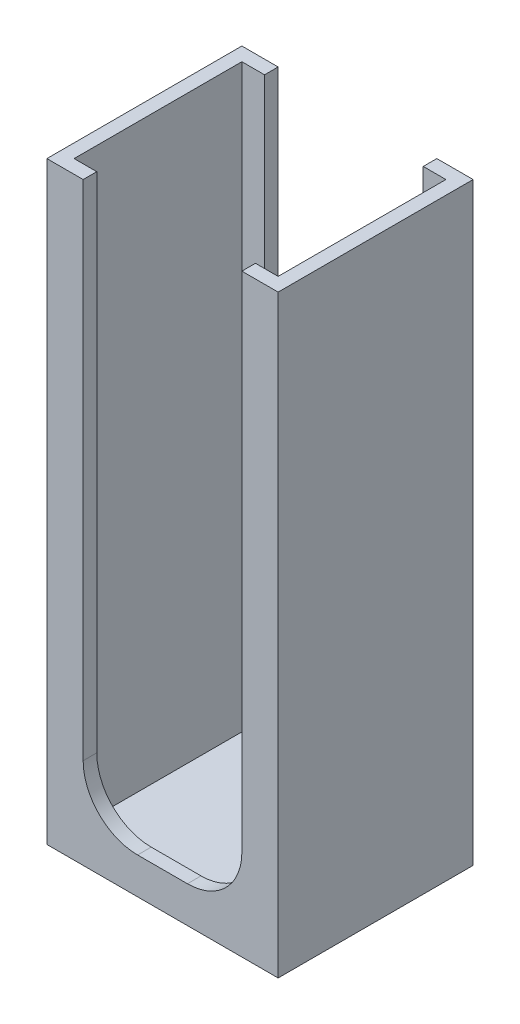
ISO-10303-21;
HEADER;
FILE_DESCRIPTION(('STEP AP214'),'2;1');
FILE_NAME('part.step','',(''),(''),'','','');
FILE_SCHEMA(('AUTOMOTIVE_DESIGN { 1 0 10303 214 1 1 1 1 }'));
ENDSEC;
DATA;
#1=APPLICATION_CONTEXT('core data for automotive mechanical design processes');
#2=APPLICATION_PROTOCOL_DEFINITION('international standard','automotive_design',2000,#1);
#3=PRODUCT_CONTEXT('',#1,'mechanical');
#4=PRODUCT('Part','Part','',(#3));
#5=PRODUCT_RELATED_PRODUCT_CATEGORY('part','',(#4));
#6=PRODUCT_DEFINITION_FORMATION('','',#4);
#7=PRODUCT_DEFINITION_CONTEXT('part definition',#1,'design');
#8=PRODUCT_DEFINITION('design','',#6,#7);
#9=PRODUCT_DEFINITION_SHAPE('','',#8);
#10=(LENGTH_UNIT() NAMED_UNIT(*) SI_UNIT(.MILLI.,.METRE.));
#11=(NAMED_UNIT(*) PLANE_ANGLE_UNIT() SI_UNIT($,.RADIAN.));
#12=(NAMED_UNIT(*) SI_UNIT($,.STERADIAN.) SOLID_ANGLE_UNIT());
#13=UNCERTAINTY_MEASURE_WITH_UNIT(LENGTH_MEASURE(1.E-05),#10,'distance_accuracy_value','');
#14=(GEOMETRIC_REPRESENTATION_CONTEXT(3) GLOBAL_UNCERTAINTY_ASSIGNED_CONTEXT((#13)) GLOBAL_UNIT_ASSIGNED_CONTEXT((#10,
#11,#12)) REPRESENTATION_CONTEXT('',''));
#15=CARTESIAN_POINT('',(0.,0.,0.));
#16=DIRECTION('',(0.,0.,1.));
#17=DIRECTION('',(1.,0.,0.));
#18=AXIS2_PLACEMENT_3D('',#15,#16,#17);
#19=CARTESIAN_POINT('',(0.,65.5,0.));
#20=DIRECTION('',(0.,-1.,0.));
#21=DIRECTION('',(0.,0.,-1.));
#22=AXIS2_PLACEMENT_3D('',#19,#20,#21);
#23=PLANE('',#22);
#24=DIRECTION('',(-1.,0.,0.));
#25=VECTOR('',#24,1.);
#26=CARTESIAN_POINT('',(-66.5960795488793,65.5,14.2931687371756));
#27=LINE('',#26,#25);
#28=CARTESIAN_POINT('',(-41.0960795488793,65.5,14.2931687371756));
#29=VERTEX_POINT('',#28);
#30=CARTESIAN_POINT('',(-45.0960795488793,65.5,14.2931687371756));
#31=VERTEX_POINT('',#30);
#32=EDGE_CURVE('E189',#29,#31,#27,.T.);
#33=ORIENTED_EDGE('',*,*,#32,.T.);
#34=DIRECTION('',(0.,0.,1.));
#35=VECTOR('',#34,1.);
#36=CARTESIAN_POINT('',(-45.0960795488793,65.5,14.2931687371756));
#37=LINE('',#36,#35);
#38=CARTESIAN_POINT('',(-45.0960795488793,65.5,15.7931687371756));
#39=VERTEX_POINT('',#38);
#40=EDGE_CURVE('E170',#31,#39,#37,.T.);
#41=ORIENTED_EDGE('',*,*,#40,.T.);
#42=DIRECTION('',(-1.,0.,0.));
#43=VECTOR('',#42,1.);
#44=CARTESIAN_POINT('',(-65.0960795488793,65.5,15.7931687371756));
#45=LINE('',#44,#43);
#46=CARTESIAN_POINT('',(-42.5960795488793,65.5,15.7931687371756));
#47=VERTEX_POINT('',#46);
#48=EDGE_CURVE('E284',#47,#39,#45,.T.);
#49=ORIENTED_EDGE('',*,*,#48,.F.);
#50=DIRECTION('',(0.,0.,-1.));
#51=VECTOR('',#50,1.);
#52=CARTESIAN_POINT('',(-42.5960795488793,65.5,15.7931687371756));
#53=LINE('',#52,#51);
#54=CARTESIAN_POINT('',(-42.5960795488793,65.5,34.2931687371756));
#55=VERTEX_POINT('',#54);
#56=EDGE_CURVE('E299',#55,#47,#53,.T.);
#57=ORIENTED_EDGE('',*,*,#56,.F.);
#58=DIRECTION('',(1.,0.,0.));
#59=VECTOR('',#58,1.);
#60=CARTESIAN_POINT('',(-65.0960795488793,65.5,34.2931687371756));
#61=LINE('',#60,#59);
#62=CARTESIAN_POINT('',(-45.0960795488793,65.5,34.2931687371756));
#63=VERTEX_POINT('',#62);
#64=EDGE_CURVE('E295',#63,#55,#61,.T.);
#65=ORIENTED_EDGE('',*,*,#64,.F.);
#66=CARTESIAN_POINT('',(-45.0960795488793,65.5,35.7931687371756));
#67=VERTEX_POINT('',#66);
#68=EDGE_CURVE('E183',#63,#67,#37,.T.);
#69=ORIENTED_EDGE('',*,*,#68,.T.);
#70=DIRECTION('',(1.,0.,0.));
#71=VECTOR('',#70,1.);
#72=CARTESIAN_POINT('',(-66.5960795488793,65.5,35.7931687371756));
#73=LINE('',#72,#71);
#74=CARTESIAN_POINT('',(-41.0960795488793,65.5,35.7931687371756));
#75=VERTEX_POINT('',#74);
#76=EDGE_CURVE('E314',#67,#75,#73,.T.);
#77=ORIENTED_EDGE('',*,*,#76,.T.);
#78=DIRECTION('',(0.,0.,-1.));
#79=VECTOR('',#78,1.);
#80=CARTESIAN_POINT('',(-41.0960795488793,65.5,35.7931687371756));
#81=LINE('',#80,#79);
#82=EDGE_CURVE('E197',#75,#29,#81,.T.);
#83=ORIENTED_EDGE('',*,*,#82,.T.);
#84=EDGE_LOOP('',(#33,#41,#49,#57,#65,#69,#77,#83));
#85=FACE_BOUND('',#84,.T.);
#86=ADVANCED_FACE('F33',(#85),#23,.F.);
#87=CARTESIAN_POINT('',(-66.5960795488793,65.5,35.7931687371756));
#88=DIRECTION('',(1.,0.,0.));
#89=DIRECTION('',(0.,0.,-1.));
#90=AXIS2_PLACEMENT_3D('',#87,#88,#89);
#91=PLANE('',#90);
#92=DIRECTION('',(0.,0.,1.));
#93=VECTOR('',#92,1.);
#94=CARTESIAN_POINT('',(-66.5960795488793,0.,35.7931687371756));
#95=LINE('',#94,#93);
#96=CARTESIAN_POINT('',(-66.5960795488793,0.,14.2931687371756));
#97=VERTEX_POINT('',#96);
#98=CARTESIAN_POINT('',(-66.5960795488793,0.,35.7931687371756));
#99=VERTEX_POINT('',#98);
#100=EDGE_CURVE('E208',#97,#99,#95,.T.);
#101=ORIENTED_EDGE('',*,*,#100,.T.);
#102=DIRECTION('',(0.,-1.,0.));
#103=VECTOR('',#102,1.);
#104=CARTESIAN_POINT('',(-66.5960795488793,65.5,35.7931687371756));
#105=LINE('',#104,#103);
#106=CARTESIAN_POINT('',(-66.5960795488793,65.5,35.7931687371756));
#107=VERTEX_POINT('',#106);
#108=EDGE_CURVE('E223',#107,#99,#105,.T.);
#109=ORIENTED_EDGE('',*,*,#108,.F.);
#110=DIRECTION('',(0.,0.,1.));
#111=VECTOR('',#110,1.);
#112=CARTESIAN_POINT('',(-66.5960795488793,65.5,35.7931687371756));
#113=LINE('',#112,#111);
#114=CARTESIAN_POINT('',(-66.5960795488793,65.5,14.2931687371756));
#115=VERTEX_POINT('',#114);
#116=EDGE_CURVE('E217',#115,#107,#113,.T.);
#117=ORIENTED_EDGE('',*,*,#116,.F.);
#118=DIRECTION('',(0.,-1.,0.));
#119=VECTOR('',#118,1.);
#120=CARTESIAN_POINT('',(-66.5960795488793,65.5,14.2931687371756));
#121=LINE('',#120,#119);
#122=EDGE_CURVE('E199',#115,#97,#121,.T.);
#123=ORIENTED_EDGE('',*,*,#122,.T.);
#124=EDGE_LOOP('',(#101,#109,#117,#123));
#125=FACE_BOUND('',#124,.T.);
#126=ADVANCED_FACE('F35',(#125),#91,.F.);
#127=CARTESIAN_POINT('',(-66.5960795488793,65.5,35.7931687371756));
#128=DIRECTION('',(0.,0.,-1.));
#129=DIRECTION('',(-1.,0.,0.));
#130=AXIS2_PLACEMENT_3D('',#127,#128,#129);
#131=PLANE('',#130);
#132=ORIENTED_EDGE('',*,*,#76,.F.);
#133=DIRECTION('',(0.,1.,0.));
#134=VECTOR('',#133,1.);
#135=CARTESIAN_POINT('',(-45.0960795488793,65.5,35.7931687371756));
#136=LINE('',#135,#134);
#137=CARTESIAN_POINT('',(-45.0960795488793,10.,35.7931687371756));
#138=VERTEX_POINT('',#137);
#139=EDGE_CURVE('E362',#138,#67,#136,.T.);
#140=ORIENTED_EDGE('',*,*,#139,.F.);
#141=CARTESIAN_POINT('',(-51.0960795488793,10.,35.7931687371756));
#142=DIRECTION('',(0.,0.,1.));
#143=DIRECTION('',(-1.,0.,0.));
#144=AXIS2_PLACEMENT_3D('',#141,#142,#143);
#145=CIRCLE('',#144,6.);
#146=CARTESIAN_POINT('',(-51.0960795488794,4.,35.7931687371756));
#147=VERTEX_POINT('',#146);
#148=EDGE_CURVE('E194',#147,#138,#145,.T.);
#149=ORIENTED_EDGE('',*,*,#148,.F.);
#150=DIRECTION('',(1.,0.,0.));
#151=VECTOR('',#150,1.);
#152=CARTESIAN_POINT('',(-51.0960795488794,4.,35.7931687371756));
#153=LINE('',#152,#151);
#154=CARTESIAN_POINT('',(-56.5960795488793,4.,35.7931687371756));
#155=VERTEX_POINT('',#154);
#156=EDGE_CURVE('E250',#155,#147,#153,.T.);
#157=ORIENTED_EDGE('',*,*,#156,.F.);
#158=CARTESIAN_POINT('',(-56.5960795488793,10.,35.7931687371756));
#159=DIRECTION('',(0.,0.,1.));
#160=DIRECTION('',(-1.,0.,0.));
#161=AXIS2_PLACEMENT_3D('',#158,#159,#160);
#162=CIRCLE('',#161,6.);
#163=CARTESIAN_POINT('',(-62.5960795488793,10.,35.7931687371756));
#164=VERTEX_POINT('',#163);
#165=EDGE_CURVE('E361',#164,#155,#162,.T.);
#166=ORIENTED_EDGE('',*,*,#165,.F.);
#167=DIRECTION('',(0.,-1.,0.));
#168=VECTOR('',#167,1.);
#169=CARTESIAN_POINT('',(-62.5960795488793,65.5,35.7931687371756));
#170=LINE('',#169,#168);
#171=CARTESIAN_POINT('',(-62.5960795488793,65.5,35.7931687371756));
#172=VERTEX_POINT('',#171);
#173=EDGE_CURVE('E358',#172,#164,#170,.T.);
#174=ORIENTED_EDGE('',*,*,#173,.F.);
#175=EDGE_CURVE('E315',#107,#172,#73,.T.);
#176=ORIENTED_EDGE('',*,*,#175,.F.);
#177=ORIENTED_EDGE('',*,*,#108,.T.);
#178=DIRECTION('',(1.,0.,0.));
#179=VECTOR('',#178,1.);
#180=CARTESIAN_POINT('',(-66.5960795488793,0.,35.7931687371756));
#181=LINE('',#180,#179);
#182=CARTESIAN_POINT('',(-41.0960795488793,0.,35.7931687371756));
#183=VERTEX_POINT('',#182);
#184=EDGE_CURVE('E211',#99,#183,#181,.T.);
#185=ORIENTED_EDGE('',*,*,#184,.T.);
#186=DIRECTION('',(0.,-1.,0.));
#187=VECTOR('',#186,1.);
#188=CARTESIAN_POINT('',(-41.0960795488793,65.5,35.7931687371756));
#189=LINE('',#188,#187);
#190=EDGE_CURVE('E220',#75,#183,#189,.T.);
#191=ORIENTED_EDGE('',*,*,#190,.F.);
#192=EDGE_LOOP('',(#132,#140,#149,#157,#166,#174,#176,#177,#185,#191));
#193=FACE_BOUND('',#192,.T.);
#194=ADVANCED_FACE('F324',(#193),#131,.F.);
#195=CARTESIAN_POINT('',(-41.0960795488793,65.5,35.7931687371756));
#196=DIRECTION('',(-1.,0.,0.));
#197=DIRECTION('',(0.,0.,1.));
#198=AXIS2_PLACEMENT_3D('',#195,#196,#197);
#199=PLANE('',#198);
#200=DIRECTION('',(0.,0.,-1.));
#201=VECTOR('',#200,1.);
#202=CARTESIAN_POINT('',(-41.0960795488793,0.,35.7931687371756));
#203=LINE('',#202,#201);
#204=CARTESIAN_POINT('',(-41.0960795488793,0.,14.2931687371756));
#205=VERTEX_POINT('',#204);
#206=EDGE_CURVE('E214',#183,#205,#203,.T.);
#207=ORIENTED_EDGE('',*,*,#206,.T.);
#208=DIRECTION('',(0.,-1.,0.));
#209=VECTOR('',#208,1.);
#210=CARTESIAN_POINT('',(-41.0960795488793,65.5,14.2931687371756));
#211=LINE('',#210,#209);
#212=EDGE_CURVE('E203',#29,#205,#211,.T.);
#213=ORIENTED_EDGE('',*,*,#212,.F.);
#214=ORIENTED_EDGE('',*,*,#82,.F.);
#215=ORIENTED_EDGE('',*,*,#190,.T.);
#216=EDGE_LOOP('',(#207,#213,#214,#215));
#217=FACE_BOUND('',#216,.T.);
#218=ADVANCED_FACE('F327',(#217),#199,.F.);
#219=CARTESIAN_POINT('',(-66.5960795488793,65.5,14.2931687371756));
#220=DIRECTION('',(0.,0.,1.));
#221=DIRECTION('',(1.,0.,0.));
#222=AXIS2_PLACEMENT_3D('',#219,#220,#221);
#223=PLANE('',#222);
#224=CARTESIAN_POINT('',(-51.0960795488793,10.,14.2931687371756));
#225=DIRECTION('',(0.,0.,1.));
#226=DIRECTION('',(-1.,0.,0.));
#227=AXIS2_PLACEMENT_3D('',#224,#225,#226);
#228=CIRCLE('',#227,6.);
#229=CARTESIAN_POINT('',(-51.0960795488794,4.,14.2931687371756));
#230=VERTEX_POINT('',#229);
#231=CARTESIAN_POINT('',(-45.0960795488793,10.,14.2931687371756));
#232=VERTEX_POINT('',#231);
#233=EDGE_CURVE('E192',#230,#232,#228,.T.);
#234=ORIENTED_EDGE('',*,*,#233,.T.);
#235=DIRECTION('',(0.,1.,0.));
#236=VECTOR('',#235,1.);
#237=CARTESIAN_POINT('',(-45.0960795488793,65.5,14.2931687371756));
#238=LINE('',#237,#236);
#239=EDGE_CURVE('E174',#232,#31,#238,.T.);
#240=ORIENTED_EDGE('',*,*,#239,.T.);
#241=ORIENTED_EDGE('',*,*,#32,.F.);
#242=ORIENTED_EDGE('',*,*,#212,.T.);
#243=DIRECTION('',(-1.,0.,0.));
#244=VECTOR('',#243,1.);
#245=CARTESIAN_POINT('',(-66.5960795488793,0.,14.2931687371756));
#246=LINE('',#245,#244);
#247=EDGE_CURVE('E216',#205,#97,#246,.T.);
#248=ORIENTED_EDGE('',*,*,#247,.T.);
#249=ORIENTED_EDGE('',*,*,#122,.F.);
#250=CARTESIAN_POINT('',(-62.5960795488793,65.5,14.2931687371756));
#251=VERTEX_POINT('',#250);
#252=EDGE_CURVE('E200',#251,#115,#27,.T.);
#253=ORIENTED_EDGE('',*,*,#252,.F.);
#254=DIRECTION('',(0.,-1.,0.));
#255=VECTOR('',#254,1.);
#256=CARTESIAN_POINT('',(-62.5960795488793,65.5,14.2931687371756));
#257=LINE('',#256,#255);
#258=CARTESIAN_POINT('',(-62.5960795488793,10.,14.2931687371756));
#259=VERTEX_POINT('',#258);
#260=EDGE_CURVE('E193',#251,#259,#257,.T.);
#261=ORIENTED_EDGE('',*,*,#260,.T.);
#262=CARTESIAN_POINT('',(-56.5960795488793,10.,14.2931687371756));
#263=DIRECTION('',(0.,0.,1.));
#264=DIRECTION('',(-1.,0.,0.));
#265=AXIS2_PLACEMENT_3D('',#262,#263,#264);
#266=CIRCLE('',#265,6.);
#267=CARTESIAN_POINT('',(-56.5960795488793,4.,14.2931687371756));
#268=VERTEX_POINT('',#267);
#269=EDGE_CURVE('E379',#259,#268,#266,.T.);
#270=ORIENTED_EDGE('',*,*,#269,.T.);
#271=DIRECTION('',(1.,0.,0.));
#272=VECTOR('',#271,1.);
#273=CARTESIAN_POINT('',(-51.0960795488794,4.,14.2931687371756));
#274=LINE('',#273,#272);
#275=EDGE_CURVE('E375',#268,#230,#274,.T.);
#276=ORIENTED_EDGE('',*,*,#275,.T.);
#277=EDGE_LOOP('',(#234,#240,#241,#242,#248,#249,#253,#261,#270,#276));
#278=FACE_BOUND('',#277,.T.);
#279=ADVANCED_FACE('F187',(#278),#223,.F.);
#280=ORIENTED_EDGE('',*,*,#175,.T.);
#281=DIRECTION('',(0.,0.,1.));
#282=VECTOR('',#281,1.);
#283=CARTESIAN_POINT('',(-62.5960795488793,65.5,14.2931687371756));
#284=LINE('',#283,#282);
#285=CARTESIAN_POINT('',(-62.5960795488793,65.5,34.2931687371756));
#286=VERTEX_POINT('',#285);
#287=EDGE_CURVE('E182',#286,#172,#284,.T.);
#288=ORIENTED_EDGE('',*,*,#287,.F.);
#289=CARTESIAN_POINT('',(-65.0960795488793,65.5,34.2931687371756));
#290=VERTEX_POINT('',#289);
#291=EDGE_CURVE('E296',#290,#286,#61,.T.);
#292=ORIENTED_EDGE('',*,*,#291,.F.);
#293=DIRECTION('',(0.,0.,1.));
#294=VECTOR('',#293,1.);
#295=CARTESIAN_POINT('',(-65.0960795488793,65.5,15.7931687371756));
#296=LINE('',#295,#294);
#297=CARTESIAN_POINT('',(-65.0960795488793,65.5,15.7931687371756));
#298=VERTEX_POINT('',#297);
#299=EDGE_CURVE('E279',#298,#290,#296,.T.);
#300=ORIENTED_EDGE('',*,*,#299,.F.);
#301=CARTESIAN_POINT('',(-62.5960795488793,65.5,15.7931687371756));
#302=VERTEX_POINT('',#301);
#303=EDGE_CURVE('E302',#302,#298,#45,.T.);
#304=ORIENTED_EDGE('',*,*,#303,.F.);
#305=EDGE_CURVE('E48',#251,#302,#284,.T.);
#306=ORIENTED_EDGE('',*,*,#305,.F.);
#307=ORIENTED_EDGE('',*,*,#252,.T.);
#308=ORIENTED_EDGE('',*,*,#116,.T.);
#309=EDGE_LOOP('',(#280,#288,#292,#300,#304,#306,#307,#308));
#310=FACE_BOUND('',#309,.T.);
#311=ADVANCED_FACE('F339',(#310),#23,.F.);
#312=CARTESIAN_POINT('',(0.,0.,0.));
#313=DIRECTION('',(0.,-1.,0.));
#314=DIRECTION('',(0.,0.,-1.));
#315=AXIS2_PLACEMENT_3D('',#312,#313,#314);
#316=PLANE('',#315);
#317=ORIENTED_EDGE('',*,*,#100,.F.);
#318=ORIENTED_EDGE('',*,*,#247,.F.);
#319=ORIENTED_EDGE('',*,*,#206,.F.);
#320=ORIENTED_EDGE('',*,*,#184,.F.);
#321=EDGE_LOOP('',(#317,#318,#319,#320));
#322=FACE_BOUND('',#321,.T.);
#323=ADVANCED_FACE('F332',(#322),#316,.T.);
#324=CARTESIAN_POINT('',(-65.0960795488793,1.5,15.7931687371756));
#325=DIRECTION('',(-1.,0.,0.));
#326=DIRECTION('',(0.,0.,1.));
#327=AXIS2_PLACEMENT_3D('',#324,#325,#326);
#328=PLANE('',#327);
#329=ORIENTED_EDGE('',*,*,#299,.T.);
#330=DIRECTION('',(0.,1.,0.));
#331=VECTOR('',#330,1.);
#332=CARTESIAN_POINT('',(-65.0960795488793,1.5,34.2931687371756));
#333=LINE('',#332,#331);
#334=CARTESIAN_POINT('',(-65.0960795488793,1.5,34.2931687371756));
#335=VERTEX_POINT('',#334);
#336=EDGE_CURVE('E293',#335,#290,#333,.T.);
#337=ORIENTED_EDGE('',*,*,#336,.F.);
#338=DIRECTION('',(0.,0.,1.));
#339=VECTOR('',#338,1.);
#340=CARTESIAN_POINT('',(-65.0960795488793,1.5,15.7931687371756));
#341=LINE('',#340,#339);
#342=CARTESIAN_POINT('',(-65.0960795488793,1.5,15.7931687371756));
#343=VERTEX_POINT('',#342);
#344=EDGE_CURVE('E280',#343,#335,#341,.T.);
#345=ORIENTED_EDGE('',*,*,#344,.F.);
#346=DIRECTION('',(0.,1.,0.));
#347=VECTOR('',#346,1.);
#348=CARTESIAN_POINT('',(-65.0960795488793,1.5,15.7931687371756));
#349=LINE('',#348,#347);
#350=EDGE_CURVE('E212',#343,#298,#349,.T.);
#351=ORIENTED_EDGE('',*,*,#350,.T.);
#352=EDGE_LOOP('',(#329,#337,#345,#351));
#353=FACE_BOUND('',#352,.T.);
#354=ADVANCED_FACE('F348',(#353),#328,.F.);
#355=CARTESIAN_POINT('',(-65.0960795488793,1.5,15.7931687371756));
#356=DIRECTION('',(0.,0.,-1.));
#357=DIRECTION('',(-1.,0.,0.));
#358=AXIS2_PLACEMENT_3D('',#355,#356,#357);
#359=PLANE('',#358);
#360=ORIENTED_EDGE('',*,*,#48,.T.);
#361=DIRECTION('',(0.,-1.,0.));
#362=VECTOR('',#361,1.);
#363=CARTESIAN_POINT('',(-45.0960795488793,1.5,15.7931687371756));
#364=LINE('',#363,#362);
#365=CARTESIAN_POINT('',(-45.0960795488793,10.,15.7931687371756));
#366=VERTEX_POINT('',#365);
#367=EDGE_CURVE('E177',#39,#366,#364,.T.);
#368=ORIENTED_EDGE('',*,*,#367,.T.);
#369=CARTESIAN_POINT('',(-51.0960795488793,10.,15.7931687371756));
#370=DIRECTION('',(0.,0.,-1.));
#371=DIRECTION('',(-1.,0.,0.));
#372=AXIS2_PLACEMENT_3D('',#369,#370,#371);
#373=CIRCLE('',#372,6.);
#374=CARTESIAN_POINT('',(-51.0960795488794,4.,15.7931687371756));
#375=VERTEX_POINT('',#374);
#376=EDGE_CURVE('E275',#366,#375,#373,.T.);
#377=ORIENTED_EDGE('',*,*,#376,.T.);
#378=DIRECTION('',(-1.,0.,0.));
#379=VECTOR('',#378,1.);
#380=CARTESIAN_POINT('',(-65.0960795488793,4.,15.7931687371756));
#381=LINE('',#380,#379);
#382=CARTESIAN_POINT('',(-56.5960795488793,4.,15.7931687371756));
#383=VERTEX_POINT('',#382);
#384=EDGE_CURVE('E272',#375,#383,#381,.T.);
#385=ORIENTED_EDGE('',*,*,#384,.T.);
#386=CARTESIAN_POINT('',(-56.5960795488793,10.,15.7931687371756));
#387=DIRECTION('',(0.,0.,-1.));
#388=DIRECTION('',(-1.,0.,0.));
#389=AXIS2_PLACEMENT_3D('',#386,#387,#388);
#390=CIRCLE('',#389,6.);
#391=CARTESIAN_POINT('',(-62.5960795488793,10.,15.7931687371756));
#392=VERTEX_POINT('',#391);
#393=EDGE_CURVE('E269',#383,#392,#390,.T.);
#394=ORIENTED_EDGE('',*,*,#393,.T.);
#395=DIRECTION('',(0.,1.,0.));
#396=VECTOR('',#395,1.);
#397=CARTESIAN_POINT('',(-62.5960795488793,1.5,15.7931687371756));
#398=LINE('',#397,#396);
#399=EDGE_CURVE('E267',#392,#302,#398,.T.);
#400=ORIENTED_EDGE('',*,*,#399,.T.);
#401=ORIENTED_EDGE('',*,*,#303,.T.);
#402=ORIENTED_EDGE('',*,*,#350,.F.);
#403=DIRECTION('',(-1.,0.,0.));
#404=VECTOR('',#403,1.);
#405=CARTESIAN_POINT('',(-65.0960795488793,1.5,15.7931687371756));
#406=LINE('',#405,#404);
#407=CARTESIAN_POINT('',(-42.5960795488793,1.5,15.7931687371756));
#408=VERTEX_POINT('',#407);
#409=EDGE_CURVE('E290',#408,#343,#406,.T.);
#410=ORIENTED_EDGE('',*,*,#409,.F.);
#411=DIRECTION('',(0.,1.,0.));
#412=VECTOR('',#411,1.);
#413=CARTESIAN_POINT('',(-42.5960795488793,1.5,15.7931687371756));
#414=LINE('',#413,#412);
#415=EDGE_CURVE('E306',#408,#47,#414,.T.);
#416=ORIENTED_EDGE('',*,*,#415,.T.);
#417=EDGE_LOOP('',(#360,#368,#377,#385,#394,#400,#401,#402,#410,#416));
#418=FACE_BOUND('',#417,.T.);
#419=ADVANCED_FACE('F344',(#418),#359,.F.);
#420=CARTESIAN_POINT('',(-42.5960795488793,1.5,15.7931687371756));
#421=DIRECTION('',(1.,0.,0.));
#422=DIRECTION('',(0.,0.,-1.));
#423=AXIS2_PLACEMENT_3D('',#420,#421,#422);
#424=PLANE('',#423);
#425=ORIENTED_EDGE('',*,*,#56,.T.);
#426=ORIENTED_EDGE('',*,*,#415,.F.);
#427=DIRECTION('',(0.,0.,-1.));
#428=VECTOR('',#427,1.);
#429=CARTESIAN_POINT('',(-42.5960795488793,1.5,15.7931687371756));
#430=LINE('',#429,#428);
#431=CARTESIAN_POINT('',(-42.5960795488793,1.5,34.2931687371756));
#432=VERTEX_POINT('',#431);
#433=EDGE_CURVE('E287',#432,#408,#430,.T.);
#434=ORIENTED_EDGE('',*,*,#433,.F.);
#435=DIRECTION('',(0.,1.,0.));
#436=VECTOR('',#435,1.);
#437=CARTESIAN_POINT('',(-42.5960795488793,1.5,34.2931687371756));
#438=LINE('',#437,#436);
#439=EDGE_CURVE('E308',#432,#55,#438,.T.);
#440=ORIENTED_EDGE('',*,*,#439,.T.);
#441=EDGE_LOOP('',(#425,#426,#434,#440));
#442=FACE_BOUND('',#441,.T.);
#443=ADVANCED_FACE('F355',(#442),#424,.F.);
#444=CARTESIAN_POINT('',(-65.0960795488793,1.5,34.2931687371756));
#445=DIRECTION('',(0.,0.,1.));
#446=DIRECTION('',(1.,0.,0.));
#447=AXIS2_PLACEMENT_3D('',#444,#445,#446);
#448=PLANE('',#447);
#449=CARTESIAN_POINT('',(-51.0960795488793,10.,34.2931687371756));
#450=DIRECTION('',(0.,0.,1.));
#451=DIRECTION('',(1.,0.,0.));
#452=AXIS2_PLACEMENT_3D('',#449,#450,#451);
#453=CIRCLE('',#452,6.);
#454=CARTESIAN_POINT('',(-51.0960795488794,4.,34.2931687371756));
#455=VERTEX_POINT('',#454);
#456=CARTESIAN_POINT('',(-45.0960795488793,10.,34.2931687371756));
#457=VERTEX_POINT('',#456);
#458=EDGE_CURVE('E41',#455,#457,#453,.T.);
#459=ORIENTED_EDGE('',*,*,#458,.T.);
#460=DIRECTION('',(0.,1.,0.));
#461=VECTOR('',#460,1.);
#462=CARTESIAN_POINT('',(-45.0960795488793,1.5,34.2931687371756));
#463=LINE('',#462,#461);
#464=EDGE_CURVE('E11',#457,#63,#463,.T.);
#465=ORIENTED_EDGE('',*,*,#464,.T.);
#466=ORIENTED_EDGE('',*,*,#64,.T.);
#467=ORIENTED_EDGE('',*,*,#439,.F.);
#468=DIRECTION('',(1.,0.,0.));
#469=VECTOR('',#468,1.);
#470=CARTESIAN_POINT('',(-65.0960795488793,1.5,34.2931687371756));
#471=LINE('',#470,#469);
#472=EDGE_CURVE('E283',#335,#432,#471,.T.);
#473=ORIENTED_EDGE('',*,*,#472,.F.);
#474=ORIENTED_EDGE('',*,*,#336,.T.);
#475=ORIENTED_EDGE('',*,*,#291,.T.);
#476=DIRECTION('',(0.,-1.,0.));
#477=VECTOR('',#476,1.);
#478=CARTESIAN_POINT('',(-62.5960795488793,1.5,34.2931687371756));
#479=LINE('',#478,#477);
#480=CARTESIAN_POINT('',(-62.5960795488793,10.,34.2931687371756));
#481=VERTEX_POINT('',#480);
#482=EDGE_CURVE('E226',#286,#481,#479,.T.);
#483=ORIENTED_EDGE('',*,*,#482,.T.);
#484=CARTESIAN_POINT('',(-56.5960795488793,10.,34.2931687371756));
#485=DIRECTION('',(0.,0.,1.));
#486=DIRECTION('',(1.,0.,0.));
#487=AXIS2_PLACEMENT_3D('',#484,#485,#486);
#488=CIRCLE('',#487,6.);
#489=CARTESIAN_POINT('',(-56.5960795488793,4.,34.2931687371756));
#490=VERTEX_POINT('',#489);
#491=EDGE_CURVE('E229',#481,#490,#488,.T.);
#492=ORIENTED_EDGE('',*,*,#491,.T.);
#493=DIRECTION('',(1.,0.,0.));
#494=VECTOR('',#493,1.);
#495=CARTESIAN_POINT('',(-65.0960795488793,4.,34.2931687371756));
#496=LINE('',#495,#494);
#497=EDGE_CURVE('E232',#490,#455,#496,.T.);
#498=ORIENTED_EDGE('',*,*,#497,.T.);
#499=EDGE_LOOP('',(#459,#465,#466,#467,#473,#474,#475,#483,#492,#498));
#500=FACE_BOUND('',#499,.T.);
#501=ADVANCED_FACE('F236',(#500),#448,.F.);
#502=CARTESIAN_POINT('',(0.,1.5,0.));
#503=DIRECTION('',(0.,1.,0.));
#504=DIRECTION('',(0.,0.,1.));
#505=AXIS2_PLACEMENT_3D('',#502,#503,#504);
#506=PLANE('',#505);
#507=ORIENTED_EDGE('',*,*,#344,.T.);
#508=ORIENTED_EDGE('',*,*,#472,.T.);
#509=ORIENTED_EDGE('',*,*,#433,.T.);
#510=ORIENTED_EDGE('',*,*,#409,.T.);
#511=EDGE_LOOP('',(#507,#508,#509,#510));
#512=FACE_BOUND('',#511,.T.);
#513=ADVANCED_FACE('F351',(#512),#506,.T.);
#514=CARTESIAN_POINT('',(-62.5960795488793,65.5,14.2931687371756));
#515=DIRECTION('',(-1.,0.,0.));
#516=DIRECTION('',(0.,0.,1.));
#517=AXIS2_PLACEMENT_3D('',#514,#515,#516);
#518=PLANE('',#517);
#519=ORIENTED_EDGE('',*,*,#287,.T.);
#520=ORIENTED_EDGE('',*,*,#173,.T.);
#521=DIRECTION('',(0.,0.,1.));
#522=VECTOR('',#521,1.);
#523=CARTESIAN_POINT('',(-62.5960795488793,10.,14.2931687371756));
#524=LINE('',#523,#522);
#525=EDGE_CURVE('E56',#481,#164,#524,.T.);
#526=ORIENTED_EDGE('',*,*,#525,.F.);
#527=ORIENTED_EDGE('',*,*,#482,.F.);
#528=EDGE_LOOP('',(#519,#520,#526,#527));
#529=FACE_BOUND('',#528,.T.);
#530=ADVANCED_FACE('F357',(#529),#518,.F.);
#531=CARTESIAN_POINT('',(-56.5960795488793,10.,14.2931687371756));
#532=DIRECTION('',(0.,0.,1.));
#533=DIRECTION('',(1.,0.,0.));
#534=AXIS2_PLACEMENT_3D('',#531,#532,#533);
#535=CYLINDRICAL_SURFACE('',#534,6.);
#536=ORIENTED_EDGE('',*,*,#525,.T.);
#537=ORIENTED_EDGE('',*,*,#165,.T.);
#538=DIRECTION('',(0.,0.,1.));
#539=VECTOR('',#538,1.);
#540=CARTESIAN_POINT('',(-56.5960795488793,4.,14.2931687371756));
#541=LINE('',#540,#539);
#542=EDGE_CURVE('E257',#490,#155,#541,.T.);
#543=ORIENTED_EDGE('',*,*,#542,.F.);
#544=ORIENTED_EDGE('',*,*,#491,.F.);
#545=EDGE_LOOP('',(#536,#537,#543,#544));
#546=FACE_BOUND('',#545,.T.);
#547=ADVANCED_FACE('F390',(#546),#535,.F.);
#548=CARTESIAN_POINT('',(-51.0960795488794,4.,14.2931687371756));
#549=DIRECTION('',(0.,-1.,0.));
#550=DIRECTION('',(0.,0.,-1.));
#551=AXIS2_PLACEMENT_3D('',#548,#549,#550);
#552=PLANE('',#551);
#553=ORIENTED_EDGE('',*,*,#542,.T.);
#554=ORIENTED_EDGE('',*,*,#156,.T.);
#555=DIRECTION('',(0.,0.,1.));
#556=VECTOR('',#555,1.);
#557=CARTESIAN_POINT('',(-51.0960795488794,4.,14.2931687371756));
#558=LINE('',#557,#556);
#559=EDGE_CURVE('E243',#455,#147,#558,.T.);
#560=ORIENTED_EDGE('',*,*,#559,.F.);
#561=ORIENTED_EDGE('',*,*,#497,.F.);
#562=EDGE_LOOP('',(#553,#554,#560,#561));
#563=FACE_BOUND('',#562,.T.);
#564=ADVANCED_FACE('F247',(#563),#552,.F.);
#565=CARTESIAN_POINT('',(-51.0960795488793,10.,14.2931687371756));
#566=DIRECTION('',(0.,0.,1.));
#567=DIRECTION('',(1.,0.,0.));
#568=AXIS2_PLACEMENT_3D('',#565,#566,#567);
#569=CYLINDRICAL_SURFACE('',#568,6.);
#570=ORIENTED_EDGE('',*,*,#559,.T.);
#571=ORIENTED_EDGE('',*,*,#148,.T.);
#572=DIRECTION('',(0.,0.,1.));
#573=VECTOR('',#572,1.);
#574=CARTESIAN_POINT('',(-45.0960795488793,10.,14.2931687371756));
#575=LINE('',#574,#573);
#576=EDGE_CURVE('E245',#457,#138,#575,.T.);
#577=ORIENTED_EDGE('',*,*,#576,.F.);
#578=ORIENTED_EDGE('',*,*,#458,.F.);
#579=EDGE_LOOP('',(#570,#571,#577,#578));
#580=FACE_BOUND('',#579,.T.);
#581=ADVANCED_FACE('F241',(#580),#569,.F.);
#582=CARTESIAN_POINT('',(-45.0960795488793,65.5,14.2931687371756));
#583=DIRECTION('',(1.,0.,0.));
#584=DIRECTION('',(0.,1.,0.));
#585=AXIS2_PLACEMENT_3D('',#582,#583,#584);
#586=PLANE('',#585);
#587=ORIENTED_EDGE('',*,*,#576,.T.);
#588=ORIENTED_EDGE('',*,*,#139,.T.);
#589=ORIENTED_EDGE('',*,*,#68,.F.);
#590=ORIENTED_EDGE('',*,*,#464,.F.);
#591=EDGE_LOOP('',(#587,#588,#589,#590));
#592=FACE_BOUND('',#591,.T.);
#593=ADVANCED_FACE('F369',(#592),#586,.F.);
#594=ORIENTED_EDGE('',*,*,#40,.F.);
#595=ORIENTED_EDGE('',*,*,#239,.F.);
#596=EDGE_CURVE('E260',#232,#366,#575,.T.);
#597=ORIENTED_EDGE('',*,*,#596,.T.);
#598=ORIENTED_EDGE('',*,*,#367,.F.);
#599=EDGE_LOOP('',(#594,#595,#597,#598));
#600=FACE_BOUND('',#599,.T.);
#601=ADVANCED_FACE('F172',(#600),#586,.F.);
#602=ORIENTED_EDGE('',*,*,#596,.F.);
#603=ORIENTED_EDGE('',*,*,#233,.F.);
#604=EDGE_CURVE('E252',#230,#375,#558,.T.);
#605=ORIENTED_EDGE('',*,*,#604,.T.);
#606=ORIENTED_EDGE('',*,*,#376,.F.);
#607=EDGE_LOOP('',(#602,#603,#605,#606));
#608=FACE_BOUND('',#607,.T.);
#609=ADVANCED_FACE('F371',(#608),#569,.F.);
#610=ORIENTED_EDGE('',*,*,#604,.F.);
#611=ORIENTED_EDGE('',*,*,#275,.F.);
#612=EDGE_CURVE('E253',#268,#383,#541,.T.);
#613=ORIENTED_EDGE('',*,*,#612,.T.);
#614=ORIENTED_EDGE('',*,*,#384,.F.);
#615=EDGE_LOOP('',(#610,#611,#613,#614));
#616=FACE_BOUND('',#615,.T.);
#617=ADVANCED_FACE('F374',(#616),#552,.F.);
#618=ORIENTED_EDGE('',*,*,#612,.F.);
#619=ORIENTED_EDGE('',*,*,#269,.F.);
#620=EDGE_CURVE('E263',#259,#392,#524,.T.);
#621=ORIENTED_EDGE('',*,*,#620,.T.);
#622=ORIENTED_EDGE('',*,*,#393,.F.);
#623=EDGE_LOOP('',(#618,#619,#621,#622));
#624=FACE_BOUND('',#623,.T.);
#625=ADVANCED_FACE('F378',(#624),#535,.F.);
#626=ORIENTED_EDGE('',*,*,#620,.F.);
#627=ORIENTED_EDGE('',*,*,#260,.F.);
#628=ORIENTED_EDGE('',*,*,#305,.T.);
#629=ORIENTED_EDGE('',*,*,#399,.F.);
#630=EDGE_LOOP('',(#626,#627,#628,#629));
#631=FACE_BOUND('',#630,.T.);
#632=ADVANCED_FACE('F380',(#631),#518,.F.);
#633=CLOSED_SHELL('',(#86,#126,#194,#218,#279,#311,#323,#354,#419,#443,#501,#513,#530,#547,#564,
#581,#593,#601,#609,#617,#625,#632));
#634=MANIFOLD_SOLID_BREP('B2',#633);
#635=ADVANCED_BREP_SHAPE_REPRESENTATION('',(#18,#634),#14);
#636=SHAPE_DEFINITION_REPRESENTATION(#9,#635);
ENDSEC;
END-ISO-10303-21;
